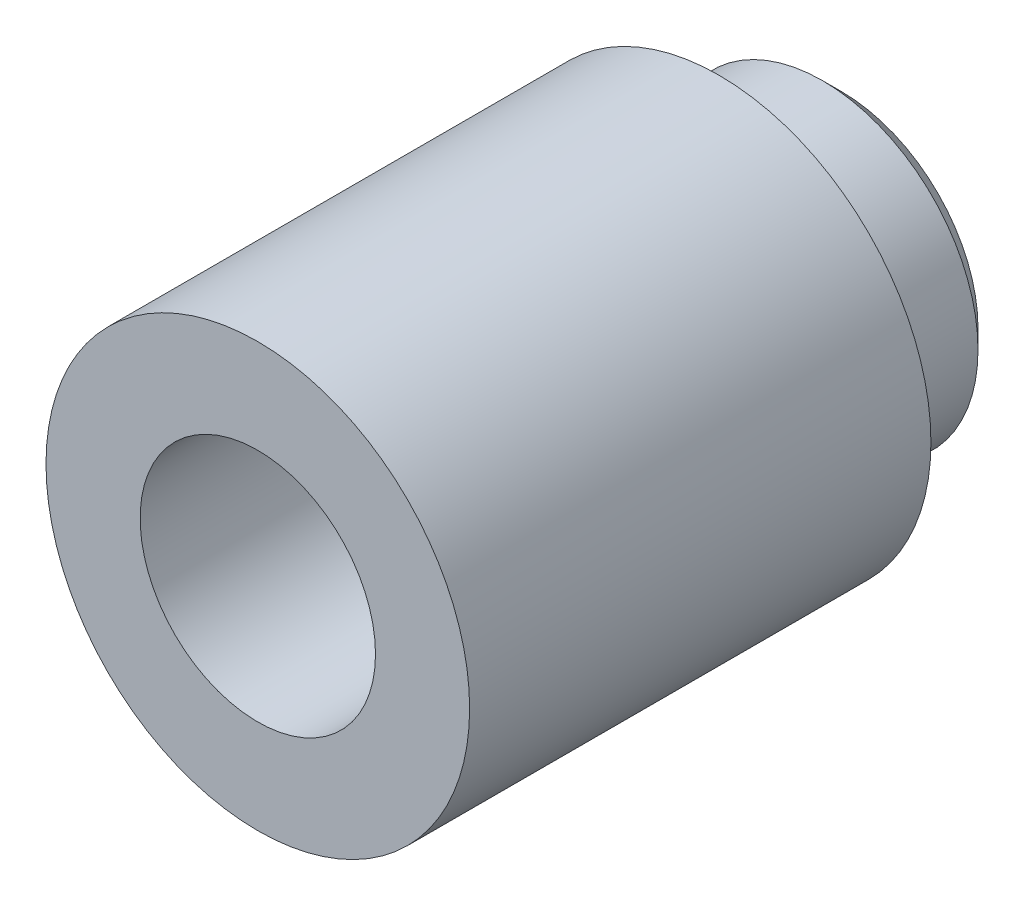
ISO-10303-21;
HEADER;
FILE_DESCRIPTION(('STEP AP214'),'2;1');
FILE_NAME('part.step','',(''),(''),'','','');
FILE_SCHEMA(('AUTOMOTIVE_DESIGN { 1 0 10303 214 1 1 1 1 }'));
ENDSEC;
DATA;
#1=APPLICATION_CONTEXT('core data for automotive mechanical design processes');
#2=APPLICATION_PROTOCOL_DEFINITION('international standard','automotive_design',2000,#1);
#3=PRODUCT_CONTEXT('',#1,'mechanical');
#4=PRODUCT('Part','Part','',(#3));
#5=PRODUCT_RELATED_PRODUCT_CATEGORY('part','',(#4));
#6=PRODUCT_DEFINITION_FORMATION('','',#4);
#7=PRODUCT_DEFINITION_CONTEXT('part definition',#1,'design');
#8=PRODUCT_DEFINITION('design','',#6,#7);
#9=PRODUCT_DEFINITION_SHAPE('','',#8);
#10=(LENGTH_UNIT() NAMED_UNIT(*) SI_UNIT(.MILLI.,.METRE.));
#11=(NAMED_UNIT(*) PLANE_ANGLE_UNIT() SI_UNIT($,.RADIAN.));
#12=(NAMED_UNIT(*) SI_UNIT($,.STERADIAN.) SOLID_ANGLE_UNIT());
#13=UNCERTAINTY_MEASURE_WITH_UNIT(LENGTH_MEASURE(1.E-05),#10,'distance_accuracy_value','');
#14=(GEOMETRIC_REPRESENTATION_CONTEXT(3) GLOBAL_UNCERTAINTY_ASSIGNED_CONTEXT((#13)) GLOBAL_UNIT_ASSIGNED_CONTEXT((#10,
#11,#12)) REPRESENTATION_CONTEXT('',''));
#15=CARTESIAN_POINT('',(0.,0.,0.));
#16=DIRECTION('',(0.,0.,1.));
#17=DIRECTION('',(1.,0.,0.));
#18=AXIS2_PLACEMENT_3D('',#15,#16,#17);
#19=CARTESIAN_POINT('',(0.,0.,-6.2));
#20=DIRECTION('',(0.,0.,1.));
#21=DIRECTION('',(1.,0.,0.));
#22=AXIS2_PLACEMENT_3D('',#19,#20,#21);
#23=CYLINDRICAL_SURFACE('',#22,2.25);
#24=CARTESIAN_POINT('',(0.,0.,0.));
#25=DIRECTION('',(0.,0.,1.));
#26=DIRECTION('',(1.,0.,0.));
#27=AXIS2_PLACEMENT_3D('',#24,#25,#26);
#28=CIRCLE('',#27,2.25);
#29=CARTESIAN_POINT('',(2.25,0.,0.));
#30=VERTEX_POINT('',#29);
#31=EDGE_CURVE('E57',#30,#30,#28,.T.);
#32=ORIENTED_EDGE('',*,*,#31,.F.);
#33=EDGE_LOOP('',(#32));
#34=FACE_BOUND('',#33,.T.);
#35=CARTESIAN_POINT('',(0.,0.,-4.9));
#36=DIRECTION('',(0.,0.,-1.));
#37=DIRECTION('',(-1.,0.,0.));
#38=AXIS2_PLACEMENT_3D('',#35,#36,#37);
#39=CIRCLE('',#38,2.25);
#40=CARTESIAN_POINT('',(-2.25,0.,-4.9));
#41=VERTEX_POINT('',#40);
#42=EDGE_CURVE('E61',#41,#41,#39,.F.);
#43=ORIENTED_EDGE('',*,*,#42,.T.);
#44=EDGE_LOOP('',(#43));
#45=FACE_BOUND('',#44,.T.);
#46=ADVANCED_FACE('F46',(#34,#45),#23,.T.);
#47=CARTESIAN_POINT('',(0.,0.,0.));
#48=DIRECTION('',(0.,0.,1.));
#49=DIRECTION('',(1.,0.,0.));
#50=AXIS2_PLACEMENT_3D('',#47,#48,#49);
#51=PLANE('',#50);
#52=CARTESIAN_POINT('',(0.,0.,0.));
#53=DIRECTION('',(0.,0.,1.));
#54=DIRECTION('',(1.,0.,0.));
#55=AXIS2_PLACEMENT_3D('',#52,#53,#54);
#56=CIRCLE('',#55,1.25);
#57=CARTESIAN_POINT('',(1.25,0.,0.));
#58=VERTEX_POINT('',#57);
#59=EDGE_CURVE('E70',#58,#58,#56,.T.);
#60=ORIENTED_EDGE('',*,*,#59,.F.);
#61=EDGE_LOOP('',(#60));
#62=FACE_BOUND('',#61,.T.);
#63=ORIENTED_EDGE('',*,*,#31,.T.);
#64=EDGE_LOOP('',(#63));
#65=FACE_BOUND('',#64,.T.);
#66=ADVANCED_FACE('F84',(#62,#65),#51,.T.);
#67=CARTESIAN_POINT('',(0.,0.,-4.9));
#68=DIRECTION('',(0.,0.,-1.));
#69=DIRECTION('',(-1.,0.,0.));
#70=AXIS2_PLACEMENT_3D('',#67,#68,#69);
#71=PLANE('',#70);
#72=ORIENTED_EDGE('',*,*,#42,.F.);
#73=EDGE_LOOP('',(#72));
#74=FACE_BOUND('',#73,.T.);
#75=CARTESIAN_POINT('',(0.,0.,-4.9));
#76=DIRECTION('',(0.,0.,-1.));
#77=DIRECTION('',(-1.,0.,0.));
#78=AXIS2_PLACEMENT_3D('',#75,#76,#77);
#79=CIRCLE('',#78,1.65);
#80=CARTESIAN_POINT('',(-1.65,0.,-4.9));
#81=VERTEX_POINT('',#80);
#82=EDGE_CURVE('E65',#81,#81,#79,.T.);
#83=ORIENTED_EDGE('',*,*,#82,.F.);
#84=EDGE_LOOP('',(#83));
#85=FACE_BOUND('',#84,.T.);
#86=ADVANCED_FACE('F87',(#74,#85),#71,.T.);
#87=CARTESIAN_POINT('',(0.,0.,-4.9));
#88=DIRECTION('',(0.,0.,-1.));
#89=DIRECTION('',(-1.,0.,0.));
#90=AXIS2_PLACEMENT_3D('',#87,#88,#89);
#91=CYLINDRICAL_SURFACE('',#90,1.65);
#92=CARTESIAN_POINT('',(0.,0.,-6.));
#93=DIRECTION('',(0.,0.,1.));
#94=DIRECTION('',(1.,0.,0.));
#95=AXIS2_PLACEMENT_3D('',#92,#93,#94);
#96=CIRCLE('',#95,1.65);
#97=CARTESIAN_POINT('',(1.65,0.,-6.));
#98=VERTEX_POINT('',#97);
#99=EDGE_CURVE('E13',#98,#98,#96,.T.);
#100=ORIENTED_EDGE('',*,*,#99,.T.);
#101=EDGE_LOOP('',(#100));
#102=FACE_BOUND('',#101,.T.);
#103=ORIENTED_EDGE('',*,*,#82,.T.);
#104=EDGE_LOOP('',(#103));
#105=FACE_BOUND('',#104,.T.);
#106=ADVANCED_FACE('F97',(#102,#105),#91,.T.);
#107=CARTESIAN_POINT('',(0.,0.,-6.2));
#108=DIRECTION('',(0.,0.,1.));
#109=DIRECTION('',(1.,0.,0.));
#110=AXIS2_PLACEMENT_3D('',#107,#108,#109);
#111=PLANE('',#110);
#112=CARTESIAN_POINT('',(0.,0.,-6.2));
#113=DIRECTION('',(0.,0.,1.));
#114=DIRECTION('',(1.,0.,0.));
#115=AXIS2_PLACEMENT_3D('',#112,#113,#114);
#116=CIRCLE('',#115,1.45);
#117=CARTESIAN_POINT('',(1.45,0.,-6.2));
#118=VERTEX_POINT('',#117);
#119=EDGE_CURVE('E53',#118,#118,#116,.F.);
#120=ORIENTED_EDGE('',*,*,#119,.T.);
#121=EDGE_LOOP('',(#120));
#122=FACE_BOUND('',#121,.T.);
#123=CARTESIAN_POINT('',(0.,0.,-6.2));
#124=DIRECTION('',(0.,0.,1.));
#125=DIRECTION('',(1.,0.,0.));
#126=AXIS2_PLACEMENT_3D('',#123,#124,#125);
#127=CIRCLE('',#126,1.25);
#128=CARTESIAN_POINT('',(1.25,0.,-6.2));
#129=VERTEX_POINT('',#128);
#130=EDGE_CURVE('E69',#129,#129,#127,.T.);
#131=ORIENTED_EDGE('',*,*,#130,.T.);
#132=EDGE_LOOP('',(#131));
#133=FACE_BOUND('',#132,.T.);
#134=ADVANCED_FACE('F76',(#122,#133),#111,.F.);
#135=CARTESIAN_POINT('',(0.,0.,-6.2));
#136=DIRECTION('',(0.,0.,1.));
#137=DIRECTION('',(1.,0.,0.));
#138=AXIS2_PLACEMENT_3D('',#135,#136,#137);
#139=CYLINDRICAL_SURFACE('',#138,1.25);
#140=ORIENTED_EDGE('',*,*,#130,.F.);
#141=EDGE_LOOP('',(#140));
#142=FACE_BOUND('',#141,.T.);
#143=ORIENTED_EDGE('',*,*,#59,.T.);
#144=EDGE_LOOP('',(#143));
#145=FACE_BOUND('',#144,.T.);
#146=ADVANCED_FACE('F78',(#142,#145),#139,.F.);
#147=CARTESIAN_POINT('',(0.,0.,-6.2));
#148=DIRECTION('',(0.,0.,1.));
#149=DIRECTION('',(1.,0.,0.));
#150=AXIS2_PLACEMENT_3D('',#147,#148,#149);
#151=CONICAL_SURFACE('',#150,1.45,0.785398163397445);
#152=ORIENTED_EDGE('',*,*,#99,.F.);
#153=EDGE_LOOP('',(#152));
#154=FACE_BOUND('',#153,.T.);
#155=ORIENTED_EDGE('',*,*,#119,.F.);
#156=EDGE_LOOP('',(#155));
#157=FACE_BOUND('',#156,.T.);
#158=ADVANCED_FACE('F48',(#154,#157),#151,.T.);
#159=CLOSED_SHELL('',(#46,#66,#86,#106,#134,#146,#158));
#160=MANIFOLD_SOLID_BREP('B2',#159);
#161=ADVANCED_BREP_SHAPE_REPRESENTATION('',(#18,#160),#14);
#162=SHAPE_DEFINITION_REPRESENTATION(#9,#161);
ENDSEC;
END-ISO-10303-21;
